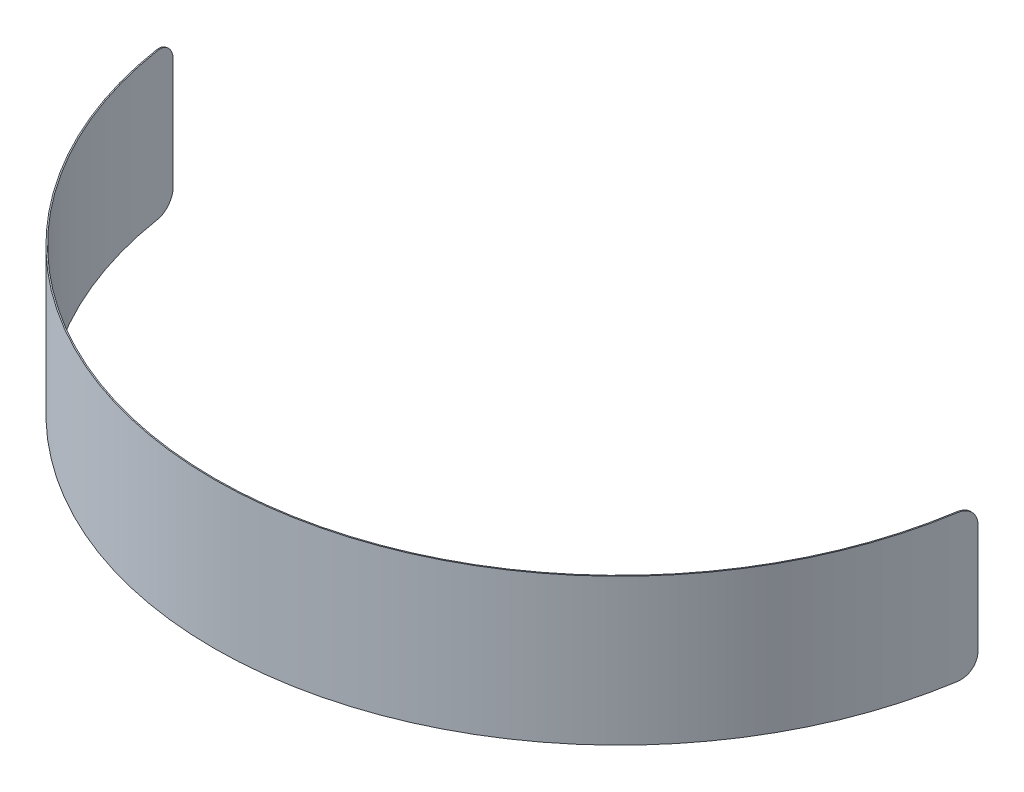
ISO-10303-21;
HEADER;
FILE_DESCRIPTION(('STEP AP214'),'2;1');
FILE_NAME('part.step','',(''),(''),'','','');
FILE_SCHEMA(('AUTOMOTIVE_DESIGN { 1 0 10303 214 1 1 1 1 }'));
ENDSEC;
DATA;
#1=APPLICATION_CONTEXT('core data for automotive mechanical design processes');
#2=APPLICATION_PROTOCOL_DEFINITION('international standard','automotive_design',2000,#1);
#3=PRODUCT_CONTEXT('',#1,'mechanical');
#4=PRODUCT('Part','Part','',(#3));
#5=PRODUCT_RELATED_PRODUCT_CATEGORY('part','',(#4));
#6=PRODUCT_DEFINITION_FORMATION('','',#4);
#7=PRODUCT_DEFINITION_CONTEXT('part definition',#1,'design');
#8=PRODUCT_DEFINITION('design','',#6,#7);
#9=PRODUCT_DEFINITION_SHAPE('','',#8);
#10=(LENGTH_UNIT() NAMED_UNIT(*) SI_UNIT(.MILLI.,.METRE.));
#11=(NAMED_UNIT(*) PLANE_ANGLE_UNIT() SI_UNIT($,.RADIAN.));
#12=(NAMED_UNIT(*) SI_UNIT($,.STERADIAN.) SOLID_ANGLE_UNIT());
#13=UNCERTAINTY_MEASURE_WITH_UNIT(LENGTH_MEASURE(1.E-05),#10,'distance_accuracy_value','');
#14=(GEOMETRIC_REPRESENTATION_CONTEXT(3) GLOBAL_UNCERTAINTY_ASSIGNED_CONTEXT((#13)) GLOBAL_UNIT_ASSIGNED_CONTEXT((#10,
#11,#12)) REPRESENTATION_CONTEXT('',''));
#15=CARTESIAN_POINT('',(0.,0.,0.));
#16=DIRECTION('',(0.,0.,1.));
#17=DIRECTION('',(1.,0.,0.));
#18=AXIS2_PLACEMENT_3D('',#15,#16,#17);
#19=CARTESIAN_POINT('',(65.1385173741729,0.0359811975371022,63.151));
#20=DIRECTION('',(0.,1.,0.));
#21=DIRECTION('',(-1.,0.,0.));
#22=AXIS2_PLACEMENT_3D('',#19,#20,#21);
#23=PLANE('',#22);
#24=CARTESIAN_POINT('',(65.1385173741729,0.0359811975371022,-44.4365));
#25=DIRECTION('',(0.,1.,0.));
#26=DIRECTION('',(-1.,0.,0.));
#27=AXIS2_PLACEMENT_3D('',#24,#25,#26);
#28=CIRCLE('',#27,44.4365);
#29=CARTESIAN_POINT('',(21.2315002120432,0.0359876084643461,-37.5971742888313));
#30=VERTEX_POINT('',#29);
#31=CARTESIAN_POINT('',(109.04553398088,0.0359888595236136,-37.5971707231431));
#32=VERTEX_POINT('',#31);
#33=EDGE_CURVE('E279',#30,#32,#28,.T.);
#34=ORIENTED_EDGE('',*,*,#33,.T.);
#35=CARTESIAN_POINT('',(109.171020713555,0.0359965025437752,-37.5776238602951));
#36=CARTESIAN_POINT('',(109.165792099664,0.0359964346935741,-37.5784383126943));
#37=CARTESIAN_POINT('',(109.160563485774,0.0359963754234303,-37.5792527650989));
#38=CARTESIAN_POINT('',(109.150106257994,0.0359962740432584,-37.5808816699163));
#39=CARTESIAN_POINT('',(109.144877644105,0.0359962319332302,-37.581696122329));
#40=CARTESIAN_POINT('',(109.134420416327,0.0359961648732905,-37.5833250271597));
#41=CARTESIAN_POINT('',(109.129191802438,0.035996139923379,-37.5841394795777));
#42=CARTESIAN_POINT('',(109.118734574661,0.0359961071836736,-37.5857683844164));
#43=CARTESIAN_POINT('',(109.113505960773,0.0359960993938798,-37.586582836837));
#44=CARTESIAN_POINT('',(109.103048732997,0.0359961009744089,-37.5882117416781));
#45=CARTESIAN_POINT('',(109.097820119109,0.035996110344732,-37.5890261940986));
#46=CARTESIAN_POINT('',(109.087362891332,0.0359961462454961,-37.5906550989368));
#47=CARTESIAN_POINT('',(109.082134277443,0.0359961727759372,-37.5914695513544));
#48=CARTESIAN_POINT('',(109.071677049665,0.0359962429969354,-37.5930984561841));
#49=CARTESIAN_POINT('',(109.066448435776,0.0359962866874926,-37.5939129085962));
#50=CARTESIAN_POINT('',(109.055991207996,0.0359963912287226,-37.595541813412));
#51=CARTESIAN_POINT('',(109.050762594105,0.0359964520793954,-37.5963562658158));
#52=CARTESIAN_POINT('',(109.045533980214,0.0359965215101258,-37.597170718214));
#53=B_SPLINE_CURVE_WITH_KNOTS('',3,(#35,#36,#37,#38,#39,#40,#41,#42,#43,#44,#45,#46,#47,#48,#49,
#50,#51,#52),.UNSPECIFIED.,.F.,.F.,(4,2,2,2,2,2,2,2,4),(0.,0.0158749999507811,
0.0317499999015549,0.0476249998523387,0.0634999998031089,0.079374999753884,0.0952499997046676,
0.11112499965545,0.126999999606222),.UNSPECIFIED.);
#54=CARTESIAN_POINT('',(109.171020712905,0.035988850040438,-37.5776238554842));
#55=VERTEX_POINT('',#54);
#56=EDGE_CURVE('E217',#55,#32,#53,.T.);
#57=ORIENTED_EDGE('',*,*,#56,.F.);
#58=CARTESIAN_POINT('',(65.1385173741729,0.0359811975371022,-44.4365));
#59=DIRECTION('',(0.,1.,0.));
#60=DIRECTION('',(-1.,0.,0.));
#61=AXIS2_PLACEMENT_3D('',#58,#59,#60);
#62=CIRCLE('',#61,44.5635);
#63=CARTESIAN_POINT('',(21.1060134773372,0.0359875942748701,-37.577627438443));
#64=VERTEX_POINT('',#63);
#65=EDGE_CURVE('E238',#64,#55,#62,.T.);
#66=ORIENTED_EDGE('',*,*,#65,.F.);
#67=CARTESIAN_POINT('',(21.1060140347908,0.0359811975371021,-37.5776238602951));
#68=DIRECTION('',(0.988084517586735,0.,-0.153912267559769));
#69=VECTOR('',#68,1.);
#70=LINE('',#67,#69);
#71=EDGE_CURVE('E275',#64,#30,#70,.T.);
#72=ORIENTED_EDGE('',*,*,#71,.T.);
#73=EDGE_LOOP('',(#34,#57,#66,#72));
#74=FACE_BOUND('',#73,.T.);
#75=ADVANCED_FACE('F200',(#74),#23,.F.);
#76=CARTESIAN_POINT('',(109.434716864185,2.0359811975371,-39.5628727070037));
#77=DIRECTION('',(-0.109363656198375,0.,0.994001806186952));
#78=DIRECTION('',(0.994001806186952,0.,0.109363656198375));
#79=AXIS2_PLACEMENT_3D('',#76,#77,#78);
#80=PLANE('',#79);
#81=DIRECTION('',(0.,1.,0.));
#82=VECTOR('',#81,1.);
#83=CARTESIAN_POINT('',(109.308478634799,2.0359811975371,-39.5767618913409));
#84=LINE('',#83,#82);
#85=CARTESIAN_POINT('',(109.308584973295,2.03598116761721,-39.5775488442539));
#86=VERTEX_POINT('',#85);
#87=CARTESIAN_POINT('',(109.30858982714,14.1141810099264,-39.577548107055));
#88=VERTEX_POINT('',#87);
#89=EDGE_CURVE('E299',#86,#88,#84,.T.);
#90=ORIENTED_EDGE('',*,*,#89,.T.);
#91=CARTESIAN_POINT('',(109.434509005933,14.1141812950622,-39.5613344610118));
#92=CARTESIAN_POINT('',(109.429266602036,14.1141812868343,-39.5620428502527));
#93=CARTESIAN_POINT('',(109.424024198139,14.1141812786065,-39.5627512394937));
#94=CARTESIAN_POINT('',(109.413539390346,14.1141812621508,-39.5641680179757));
#95=CARTESIAN_POINT('',(109.408296986449,14.114181253923,-39.5648764072166));
#96=CARTESIAN_POINT('',(109.397812178656,14.1141812374673,-39.5662931856986));
#97=CARTESIAN_POINT('',(109.392569774759,14.1141812292395,-39.5670015749395));
#98=CARTESIAN_POINT('',(109.382084966966,14.1141812127838,-39.5684183534215));
#99=CARTESIAN_POINT('',(109.376842563069,14.1141812045559,-39.5691267426625));
#100=CARTESIAN_POINT('',(109.366357755275,14.1141811881003,-39.5705435211444));
#101=CARTESIAN_POINT('',(109.361115351379,14.1141811798724,-39.5712519103854));
#102=CARTESIAN_POINT('',(109.350630543585,14.1141811634167,-39.5726686888673));
#103=CARTESIAN_POINT('',(109.345388139688,14.1141811551889,-39.5733770781083));
#104=CARTESIAN_POINT('',(109.334903331895,14.1141811387332,-39.5747938565902));
#105=CARTESIAN_POINT('',(109.329660927998,14.1141811305054,-39.5755022458312));
#106=CARTESIAN_POINT('',(109.319176120205,14.1141811140497,-39.5769190243132));
#107=CARTESIAN_POINT('',(109.313933716308,14.1141811058219,-39.5776274135541));
#108=CARTESIAN_POINT('',(109.308691312411,14.114181097594,-39.5783358027951));
#109=B_SPLINE_CURVE_WITH_KNOTS('',3,(#91,#92,#93,#94,#95,#96,#97,#98,#99,#100,#101,#102,#103,
#104,#105,#106,#107,#108),.UNSPECIFIED.,.F.,.F.,(4,2,2,2,2,2,2,2,4),(0.,0.0158701457271038,
0.0317402914542212,0.047610437181325,0.0634805829084287,0.0793507286355462,0.09522087436265,
0.111091020089767,0.12696116581687),.UNSPECIFIED.);
#110=CARTESIAN_POINT('',(109.43460819151,14.1141811333248,-39.5621043072711));
#111=VERTEX_POINT('',#110);
#112=EDGE_CURVE('E272',#111,#88,#109,.T.);
#113=ORIENTED_EDGE('',*,*,#112,.F.);
#114=DIRECTION('',(0.,1.,0.));
#115=VECTOR('',#114,1.);
#116=CARTESIAN_POINT('',(109.434716864185,0.0359811983798863,-39.5628727070037));
#117=LINE('',#116,#115);
#118=CARTESIAN_POINT('',(109.434612934762,2.03598106889212,-39.562103581294));
#119=VERTEX_POINT('',#118);
#120=EDGE_CURVE('E345',#119,#111,#117,.T.);
#121=ORIENTED_EDGE('',*,*,#120,.F.);
#122=CARTESIAN_POINT('',(109.434716864185,2.0359811975371,-39.5628727070037));
#123=DIRECTION('',(-0.994001806186952,0.,-0.109363656198377));
#124=VECTOR('',#123,1.);
#125=LINE('',#122,#124);
#126=EDGE_CURVE('E227',#119,#86,#125,.T.);
#127=ORIENTED_EDGE('',*,*,#126,.T.);
#128=EDGE_LOOP('',(#90,#113,#121,#127));
#129=FACE_BOUND('',#128,.T.);
#130=ADVANCED_FACE('F321',(#129),#80,.F.);
#131=CARTESIAN_POINT('',(111.148961859375,14.1143069446102,-37.3116312187196));
#132=DIRECTION('',(-0.99099352712004,-3.42590801119901E-11,-0.133909780099074));
#133=DIRECTION('',(-0.133909780099074,0.,0.99099352712004));
#134=AXIS2_PLACEMENT_3D('',#131,#132,#133);
#135=CYLINDRICAL_SURFACE('',#134,1.99985935040507);
#136=ORIENTED_EDGE('',*,*,#112,.T.);
#137=CARTESIAN_POINT('',(109.308652352847,14.1141809598259,-39.5783410672674));
#138=CARTESIAN_POINT('',(109.308652090242,14.1704396045123,-39.5783443125391));
#139=CARTESIAN_POINT('',(109.308393415169,14.2266714352459,-39.5759861864606));
#140=CARTESIAN_POINT('',(109.307356717354,14.3387327905778,-39.5665722367497));
#141=CARTESIAN_POINT('',(109.306578720313,14.3945623349467,-39.5595166455889));
#142=CARTESIAN_POINT('',(109.303465380226,14.560748473377,-39.5313721280404));
#143=CARTESIAN_POINT('',(109.300350701324,14.6699920000323,-39.503305276705));
#144=CARTESIAN_POINT('',(109.292027075112,14.882184089647,-39.4293569616788));
#145=CARTESIAN_POINT('',(109.286817136414,14.985129646065,-39.3834670652155));
#146=CARTESIAN_POINT('',(109.274290697902,15.1818063149062,-39.2752014051662));
#147=CARTESIAN_POINT('',(109.266974555581,15.2755389874469,-39.2128284394588));
#148=CARTESIAN_POINT('',(109.250243324593,15.4511490626311,-39.0733774350298));
#149=CARTESIAN_POINT('',(109.240827842185,15.5330242365897,-38.9962966381802));
#150=CARTESIAN_POINT('',(109.219948886978,15.682595099496,-38.8296322904499));
#151=CARTESIAN_POINT('',(109.208485021021,15.7502880609413,-38.7400463401062));
#152=CARTESIAN_POINT('',(109.183631609699,15.8695497815523,-38.5509644584667));
#153=CARTESIAN_POINT('',(109.170241999092,15.9211179942346,-38.4514681914513));
#154=CARTESIAN_POINT('',(109.141744454671,16.0066421870854,-38.245431969337));
#155=CARTESIAN_POINT('',(109.12663754148,16.0406085623024,-38.1388962135362));
#156=CARTESIAN_POINT('',(109.10047060832,16.081493021573,-37.9592798097031));
#157=CARTESIAN_POINT('',(109.08980654224,16.0936965007615,-37.8873000899286));
#158=CARTESIAN_POINT('',(109.068003127719,16.1100079289808,-37.7426063123373));
#159=CARTESIAN_POINT('',(109.056864475431,16.1141273450535,-37.6698934419542));
#160=CARTESIAN_POINT('',(109.045534535446,16.1141658712165,-37.5971742839913));
#161=B_SPLINE_CURVE_WITH_KNOTS('',3,(#137,#138,#139,#140,#141,#142,#143,#144,#145,#146,#147,
#148,#149,#150,#151,#152,#153,#154,#155,#156,#157,#158,#159,#160),.UNSPECIFIED.,.F.,.F.,(4,2,2,
2,2,2,2,2,2,2,2,4),(0.,0.168672232306347,0.337336117854877,0.674102842414998,1.01102909883541,
1.34789820122372,1.68483053814934,2.02182761405053,2.35883610987439,2.69564535243775,
2.91657133719152,3.13718371678471),.UNSPECIFIED.);
#162=CARTESIAN_POINT('',(109.045534536417,16.114174786033,-37.5971742897123));
#163=VERTEX_POINT('',#162);
#164=EDGE_CURVE('E300',#88,#163,#161,.T.);
#165=ORIENTED_EDGE('',*,*,#164,.T.);
#166=CARTESIAN_POINT('',(109.171020712255,16.1141811975371,-37.5776238506733));
#167=DIRECTION('',(-0.988084493769176,0.,-0.153912420463429));
#168=VECTOR('',#167,1.);
#169=LINE('',#166,#168);
#170=CARTESIAN_POINT('',(109.171021270897,16.1141748013611,-37.5776274375838));
#171=VERTEX_POINT('',#170);
#172=EDGE_CURVE('E458',#171,#163,#169,.T.);
#173=ORIENTED_EDGE('',*,*,#172,.F.);
#174=CARTESIAN_POINT('',(109.434547028327,14.1141811822034,-39.5613293231603));
#175=CARTESIAN_POINT('',(109.434546766998,14.1704398832439,-39.5613325619134));
#176=CARTESIAN_POINT('',(109.434287922778,14.2266717701187,-39.55897444763));
#177=CARTESIAN_POINT('',(109.433250562323,14.3387332377384,-39.5495605555614));
#178=CARTESIAN_POINT('',(109.432472071801,14.3945628382507,-39.5425050102112));
#179=CARTESIAN_POINT('',(109.429356792738,14.560749086249,-39.5143606869409));
#180=CARTESIAN_POINT('',(109.426240209701,14.6699926672824,-39.4862940408499));
#181=CARTESIAN_POINT('',(109.417911895998,14.8821848592817,-39.4123462306755));
#182=CARTESIAN_POINT('',(109.412699173621,14.985130463995,-39.3664566346759));
#183=CARTESIAN_POINT('',(109.400166821468,15.1818072866878,-39.2581915615523));
#184=CARTESIAN_POINT('',(109.392847547694,15.2755400580243,-39.1958188701737));
#185=CARTESIAN_POINT('',(109.376110362522,15.4511502607878,-39.0563683498096));
#186=CARTESIAN_POINT('',(109.366692057927,15.533025466269,-38.9792877660822));
#187=CARTESIAN_POINT('',(109.345808491457,15.6825961457432,-38.8126239503213));
#188=CARTESIAN_POINT('',(109.334342841808,15.7502889282511,-38.7230383504996));
#189=CARTESIAN_POINT('',(109.309487523288,15.8695501946775,-38.5339571114984));
#190=CARTESIAN_POINT('',(109.296097793844,15.9211181708046,-38.4344611603589));
#191=CARTESIAN_POINT('',(109.267602111634,16.0066423990151,-38.2284248147398));
#192=CARTESIAN_POINT('',(109.252497162287,16.04060888408,-38.1218885540014));
#193=CARTESIAN_POINT('',(109.22627525621,16.0815872163066,-37.9418577404744));
#194=CARTESIAN_POINT('',(109.215550179139,16.0938381338124,-37.8694550407663));
#195=CARTESIAN_POINT('',(109.193620762993,16.1101500178586,-37.7239102211033));
#196=CARTESIAN_POINT('',(109.182417118906,16.114222474337,-37.6507692837958));
#197=CARTESIAN_POINT('',(109.171021271847,16.1141658948293,-37.5776274431367));
#198=B_SPLINE_CURVE_WITH_KNOTS('',3,(#174,#175,#176,#177,#178,#179,#180,#181,#182,#183,#184,
#185,#186,#187,#188,#189,#190,#191,#192,#193,#194,#195,#196,#197),.UNSPECIFIED.,.F.,.F.,(4,2,2,
2,2,2,2,2,2,2,2,4),(0.,0.168672401462005,0.337336457411722,0.674103345597585,1.01102975035816,
1.34789924884286,1.68483190396615,2.02182844305854,2.35883559354966,2.69564659771223,
2.91785266717893,3.13974633984323),.UNSPECIFIED.);
#199=EDGE_CURVE('E343',#111,#171,#198,.T.);
#200=ORIENTED_EDGE('',*,*,#199,.F.);
#201=EDGE_LOOP('',(#136,#165,#173,#200));
#202=FACE_BOUND('',#201,.T.);
#203=ADVANCED_FACE('F316',(#202),#135,.T.);
#204=CARTESIAN_POINT('',(65.1385173741729,16.1141811975371,63.151));
#205=DIRECTION('',(0.,1.,0.));
#206=DIRECTION('',(-1.,0.,0.));
#207=AXIS2_PLACEMENT_3D('',#204,#205,#206);
#208=PLANE('',#207);
#209=ORIENTED_EDGE('',*,*,#172,.T.);
#210=CARTESIAN_POINT('',(65.1385173741729,16.1141811975371,-44.4365));
#211=DIRECTION('',(0.,1.,0.));
#212=DIRECTION('',(-1.,0.,0.));
#213=AXIS2_PLACEMENT_3D('',#210,#211,#212);
#214=CIRCLE('',#213,44.4365);
#215=CARTESIAN_POINT('',(21.2315007868884,16.1141735400378,-37.5971705982909));
#216=VERTEX_POINT('',#215);
#217=EDGE_CURVE('E447',#163,#216,#214,.F.);
#218=ORIENTED_EDGE('',*,*,#217,.T.);
#219=CARTESIAN_POINT('',(21.1060140347908,16.1141658925311,-37.5776238602951));
#220=CARTESIAN_POINT('',(21.1112426486819,16.1141659603813,-37.5784383126943));
#221=CARTESIAN_POINT('',(21.1164712625723,16.1141660196514,-37.5792527650989));
#222=CARTESIAN_POINT('',(21.126928490352,16.1141661210315,-37.5808816699163));
#223=CARTESIAN_POINT('',(21.1321571042412,16.1141661631415,-37.581696122329));
#224=CARTESIAN_POINT('',(21.1426143320191,16.1141662302015,-37.5833250271597));
#225=CARTESIAN_POINT('',(21.1478429459077,16.1141662551514,-37.5841394795777));
#226=CARTESIAN_POINT('',(21.1583001736844,16.114166287891,-37.5857683844164));
#227=CARTESIAN_POINT('',(21.1635287875727,16.1141662956808,-37.586582836837));
#228=CARTESIAN_POINT('',(21.1739860153491,16.1141662941003,-37.5882117416781));
#229=CARTESIAN_POINT('',(21.1792146292373,16.1141662847299,-37.5890261940986));
#230=CARTESIAN_POINT('',(21.1896718570142,16.1141662488292,-37.5906550989368));
#231=CARTESIAN_POINT('',(21.1949004709028,16.1141662222987,-37.5914695513544));
#232=CARTESIAN_POINT('',(21.2053576986808,16.1141661520777,-37.5930984561841));
#233=CARTESIAN_POINT('',(21.2105863125702,16.1141661083871,-37.5939129085962));
#234=CARTESIAN_POINT('',(21.22104354035,16.1141660038459,-37.595541813412));
#235=CARTESIAN_POINT('',(21.2262721542405,16.1141659429952,-37.5963562658158));
#236=CARTESIAN_POINT('',(21.2315007681318,16.1141658735644,-37.597170718214));
#237=B_SPLINE_CURVE_WITH_KNOTS('',3,(#219,#220,#221,#222,#223,#224,#225,#226,#227,#228,#229,
#230,#231,#232,#233,#234,#235,#236),.UNSPECIFIED.,.F.,.F.,(4,2,2,2,2,2,2,2,4),(0.,
0.0158749999507753,0.0317499999015491,0.047624999852325,0.0634999998030997,0.0793749997538747,
0.0952499997046505,0.111124999655423,0.126999999606199),.UNSPECIFIED.);
#238=CARTESIAN_POINT('',(21.1060140545923,16.1141735497327,-37.5776237326952));
#239=VERTEX_POINT('',#238);
#240=EDGE_CURVE('E400',#239,#216,#237,.T.);
#241=ORIENTED_EDGE('',*,*,#240,.F.);
#242=CARTESIAN_POINT('',(65.1385173741729,16.1141811975371,-44.4365));
#243=DIRECTION('',(0.,1.,0.));
#244=DIRECTION('',(-1.,0.,0.));
#245=AXIS2_PLACEMENT_3D('',#242,#243,#244);
#246=CIRCLE('',#245,44.5635);
#247=EDGE_CURVE('E427',#171,#239,#246,.F.);
#248=ORIENTED_EDGE('',*,*,#247,.F.);
#249=EDGE_LOOP('',(#209,#218,#241,#248));
#250=FACE_BOUND('',#249,.T.);
#251=ADVANCED_FACE('F320',(#250),#208,.T.);
#252=CARTESIAN_POINT('',(19.1136010260649,14.1143069445452,-37.3096756818228));
#253=DIRECTION('',(0.99099352709237,-1.68506727547382E-12,-0.133909780303845));
#254=DIRECTION('',(-0.133909780303845,0.,-0.99099352709237));
#255=AXIS2_PLACEMENT_3D('',#252,#253,#254);
#256=CYLINDRICAL_SURFACE('',#255,1.9998593504034);
#257=ORIENTED_EDGE('',*,*,#240,.T.);
#258=CARTESIAN_POINT('',(21.2315007877783,16.1141658736464,-37.5971705933941));
#259=CARTESIAN_POINT('',(21.2228469137616,16.1141290407224,-37.6527227172123));
#260=CARTESIAN_POINT('',(21.214304155381,16.1117215293452,-37.708263393953));
#261=CARTESIAN_POINT('',(21.1974881959879,16.1021888799704,-37.8189766980751));
#262=CARTESIAN_POINT('',(21.189214982178,16.0950639662893,-37.8741493428307));
#263=CARTESIAN_POINT('',(21.1648965707602,16.0666800606874,-38.038422074088));
#264=CARTESIAN_POINT('',(21.149323337369,16.0384115966868,-38.1464651084131));
#265=CARTESIAN_POINT('',(21.1198109429769,15.9639632488466,-38.3564263936552));
#266=CARTESIAN_POINT('',(21.1058725744656,15.9177747247272,-38.4583416626086));
#267=CARTESIAN_POINT('',(21.0798651245495,15.80880150428,-38.6531315130088));
#268=CARTESIAN_POINT('',(21.0677957250465,15.7460196370714,-38.7460076319158));
#269=CARTESIAN_POINT('',(21.0456682781669,15.6056247652374,-38.9200783202323));
#270=CARTESIAN_POINT('',(21.0356106521364,15.5280086603692,-39.0012704415463));
#271=CARTESIAN_POINT('',(21.0175783501076,15.3601336277533,-39.1496415726215));
#272=CARTESIAN_POINT('',(21.0096040883961,15.2698721908953,-39.2168177947207));
#273=CARTESIAN_POINT('',(20.9957565312995,15.0792157036572,-39.3352483546643));
#274=CARTESIAN_POINT('',(20.9898848612352,14.978812890438,-39.3864903712266));
#275=CARTESIAN_POINT('',(20.9802452421608,14.7707929431513,-39.4714848545792));
#276=CARTESIAN_POINT('',(20.9764760577448,14.6631800873846,-39.505247591232));
#277=CARTESIAN_POINT('',(20.9719564600462,14.4814555877175,-39.5459282629599));
#278=CARTESIAN_POINT('',(20.9706143404013,14.4084866535189,-39.5580793340271));
#279=CARTESIAN_POINT('',(20.9688282460706,14.2617490041611,-39.5742871922925));
#280=CARTESIAN_POINT('',(20.9683830062256,14.1879815633854,-39.5783553812783));
#281=CARTESIAN_POINT('',(20.9683823954956,14.1141811774558,-39.5783410672944));
#282=B_SPLINE_CURVE_WITH_KNOTS('',3,(#258,#259,#260,#261,#262,#263,#264,#265,#266,#267,#268,
#269,#270,#271,#272,#273,#274,#275,#276,#277,#278,#279,#280,#281),.UNSPECIFIED.,.F.,.F.,(4,2,2,
2,2,2,2,2,2,2,2,4),(0.,0.168562926452081,0.337117838168744,0.673663693672621,1.01037201912771,
1.347022973734,1.68374436291887,2.02053265986841,2.35758073780059,2.69443055944962,
2.91596618420241,3.13718908627537),.UNSPECIFIED.);
#283=CARTESIAN_POINT('',(20.9684497750502,14.114181227457,-39.5775488442605));
#284=VERTEX_POINT('',#283);
#285=EDGE_CURVE('E444',#216,#284,#282,.T.);
#286=ORIENTED_EDGE('',*,*,#285,.T.);
#287=CARTESIAN_POINT('',(20.8423178841607,14.1141811975371,-39.5628727070037));
#288=DIRECTION('',(0.994001806186952,0.,-0.10936365619838));
#289=VECTOR('',#288,1.);
#290=LINE('',#287,#289);
#291=CARTESIAN_POINT('',(20.8424218135848,14.1141813261821,-39.5621035812876));
#292=VERTEX_POINT('',#291);
#293=EDGE_CURVE('E463',#292,#284,#290,.T.);
#294=ORIENTED_EDGE('',*,*,#293,.F.);
#295=CARTESIAN_POINT('',(21.1060140537236,16.1141658924522,-37.5776237374758));
#296=CARTESIAN_POINT('',(21.0973601434677,16.1142012082372,-37.6331761050401));
#297=CARTESIAN_POINT('',(21.0888165774676,16.1118657937047,-37.6887199843926));
#298=CARTESIAN_POINT('',(21.0719975496707,16.1024767886614,-37.7994455961822));
#299=CARTESIAN_POINT('',(21.0637220751515,16.0954234223883,-37.854627345705));
#300=CARTESIAN_POINT('',(21.0393948524734,16.067252445956,-38.0189361386438));
#301=CARTESIAN_POINT('',(21.0238130323934,16.0391238949871,-38.1270149185701));
#302=CARTESIAN_POINT('',(20.9942790419166,15.9649471778653,-38.3370702579157));
#303=CARTESIAN_POINT('',(20.9803276619097,15.9188903670818,-38.43904384613));
#304=CARTESIAN_POINT('',(20.9542909513864,15.8101685957312,-38.6339713871239));
#305=CARTESIAN_POINT('',(20.9422053045859,15.7475064550468,-38.7269268676819));
#306=CARTESIAN_POINT('',(20.9200433981407,15.6073358976218,-38.9011748439746));
#307=CARTESIAN_POINT('',(20.9099675539957,15.5298244174584,-38.9824649270717));
#308=CARTESIAN_POINT('',(20.891897989379,15.362140695057,-39.1310479494863));
#309=CARTESIAN_POINT('',(20.883904677751,15.2719659721049,-39.1983381398166));
#310=CARTESIAN_POINT('',(20.8700191593459,15.0814627777495,-39.3170094418969));
#311=CARTESIAN_POINT('',(20.8641285666365,14.9811265818114,-39.3683783283309));
#312=CARTESIAN_POINT('',(20.8544518841747,14.773216899592,-39.4536365641188));
#313=CARTESIAN_POINT('',(20.8506645777831,14.6656476377128,-39.4875360177903));
#314=CARTESIAN_POINT('',(20.8461055687099,14.4835587528971,-39.5285413712454));
#315=CARTESIAN_POINT('',(20.8447470244476,14.4101789247804,-39.5408327649483));
#316=CARTESIAN_POINT('',(20.8429390406964,14.2626033446498,-39.5572283952551));
#317=CARTESIAN_POINT('',(20.8424883330181,14.1884088766167,-39.5613440527264));
#318=CARTESIAN_POINT('',(20.8424877200191,14.114181374973,-39.5613293231597));
#319=B_SPLINE_CURVE_WITH_KNOTS('',3,(#295,#296,#297,#298,#299,#300,#301,#302,#303,#304,#305,
#306,#307,#308,#309,#310,#311,#312,#313,#314,#315,#316,#317,#318),.UNSPECIFIED.,.F.,.F.,(4,2,2,
2,2,2,2,2,2,2,2,4),(0.,0.168563662861303,0.337119314696304,0.673666527028567,1.01037621677423,
1.34702876378186,1.68375083723829,2.02053896640851,2.35758506432969,2.69443599541072,
2.91724959531959,3.13975172247435),.UNSPECIFIED.);
#320=EDGE_CURVE('E426',#239,#292,#319,.T.);
#321=ORIENTED_EDGE('',*,*,#320,.F.);
#322=EDGE_LOOP('',(#257,#286,#294,#321));
#323=FACE_BOUND('',#322,.T.);
#324=ADVANCED_FACE('F406',(#323),#256,.T.);
#325=CARTESIAN_POINT('',(20.8423178841607,2.0359811975371,-39.5628727070037));
#326=DIRECTION('',(0.109363656198375,0.,0.994001806186952));
#327=DIRECTION('',(0.994001806186952,0.,-0.109363656198375));
#328=AXIS2_PLACEMENT_3D('',#325,#326,#327);
#329=PLANE('',#328);
#330=DIRECTION('',(0.,1.,0.));
#331=VECTOR('',#330,1.);
#332=CARTESIAN_POINT('',(20.9685561135464,2.0359811975371,-39.5767618913409));
#333=LINE('',#332,#331);
#334=CARTESIAN_POINT('',(20.9684449212043,2.03598138514784,-39.5775481070616));
#335=VERTEX_POINT('',#334);
#336=EDGE_CURVE('E295',#284,#335,#333,.F.);
#337=ORIENTED_EDGE('',*,*,#336,.T.);
#338=CARTESIAN_POINT('',(20.8425257424149,2.03598110001204,-39.5613344609991));
#339=CARTESIAN_POINT('',(20.8477681463115,2.03598110823988,-39.5620428502412));
#340=CARTESIAN_POINT('',(20.8530105502081,2.03598111646772,-39.5627512394833));
#341=CARTESIAN_POINT('',(20.8634953580012,2.0359811329234,-39.5641680179674));
#342=CARTESIAN_POINT('',(20.8687377618977,2.03598114115124,-39.5648764072094));
#343=CARTESIAN_POINT('',(20.8792225696909,2.03598115760692,-39.5662931856935));
#344=CARTESIAN_POINT('',(20.8844649735874,2.03598116583475,-39.5670015749356));
#345=CARTESIAN_POINT('',(20.8949497813805,2.03598118229043,-39.5684183534197));
#346=CARTESIAN_POINT('',(20.9001921852771,2.03598119051827,-39.5691267426617));
#347=CARTESIAN_POINT('',(20.9106769930702,2.03598120697395,-39.5705435211458));
#348=CARTESIAN_POINT('',(20.9159193969668,2.03598121520179,-39.5712519103879));
#349=CARTESIAN_POINT('',(20.9264042047599,2.03598123165747,-39.572668688872));
#350=CARTESIAN_POINT('',(20.9316466086565,2.03598123988531,-39.573377078114));
#351=CARTESIAN_POINT('',(20.9421314164496,2.03598125634098,-39.5747938565981));
#352=CARTESIAN_POINT('',(20.9473738203462,2.03598126456882,-39.5755022458402));
#353=CARTESIAN_POINT('',(20.9578586281393,2.0359812810245,-39.5769190243243));
#354=CARTESIAN_POINT('',(20.9631010320359,2.03598128925234,-39.5776274135663));
#355=CARTESIAN_POINT('',(20.9683434359324,2.03598129748018,-39.5783358028084));
#356=B_SPLINE_CURVE_WITH_KNOTS('',3,(#338,#339,#340,#341,#342,#343,#344,#345,#346,#347,#348,
#349,#350,#351,#352,#353,#354,#355),.UNSPECIFIED.,.F.,.F.,(4,2,2,2,2,2,2,2,4),(0.,
0.0158701457270288,0.0317402914540542,0.0476104371810821,0.0634805829081109,0.0793507286351363,
0.0952208743621642,0.111091020089192,0.126961165816221),.UNSPECIFIED.);
#357=CARTESIAN_POINT('',(20.8424265568374,2.03598126174937,-39.5621043072648));
#358=VERTEX_POINT('',#357);
#359=EDGE_CURVE('E285',#358,#335,#356,.T.);
#360=ORIENTED_EDGE('',*,*,#359,.F.);
#361=DIRECTION('',(0.,1.,0.));
#362=VECTOR('',#361,1.);
#363=CARTESIAN_POINT('',(20.8423178841607,0.0359811983798863,-39.5628727070037));
#364=LINE('',#363,#362);
#365=EDGE_CURVE('E373',#292,#358,#364,.F.);
#366=ORIENTED_EDGE('',*,*,#365,.F.);
#367=ORIENTED_EDGE('',*,*,#293,.T.);
#368=EDGE_LOOP('',(#337,#360,#366,#367));
#369=FACE_BOUND('',#368,.T.);
#370=ADVANCED_FACE('F378',(#369),#329,.F.);
#371=CARTESIAN_POINT('',(19.1280728889671,2.03585545053283,-37.3116312182909));
#372=DIRECTION('',(0.990993527092373,-1.87923810453408E-13,-0.133909780303821));
#373=DIRECTION('',(-0.133909780303821,0.,-0.990993527092373));
#374=AXIS2_PLACEMENT_3D('',#371,#372,#373);
#375=CYLINDRICAL_SURFACE('',#374,1.99985935040337);
#376=ORIENTED_EDGE('',*,*,#359,.T.);
#377=CARTESIAN_POINT('',(20.9683823954971,2.03598143524827,-39.5783410672808));
#378=CARTESIAN_POINT('',(20.9683826581023,1.9797227905621,-39.5783443125526));
#379=CARTESIAN_POINT('',(20.9686413331756,1.92349095982875,-39.5759861864743));
#380=CARTESIAN_POINT('',(20.9696780309905,1.81142960449723,-39.5665722367636));
#381=CARTESIAN_POINT('',(20.9704560280315,1.75560006012862,-39.559516645603));
#382=CARTESIAN_POINT('',(20.9735693681178,1.58941392169893,-39.5313721280549));
#383=CARTESIAN_POINT('',(20.9766840470207,1.48017039504407,-39.5033052767198));
#384=CARTESIAN_POINT('',(20.9850076732318,1.26797830543016,-39.4293569616943));
#385=CARTESIAN_POINT('',(20.99021761193,1.16503274901255,-39.3834670652314));
#386=CARTESIAN_POINT('',(21.0027440504422,0.968356080171973,-39.2752014051831));
#387=CARTESIAN_POINT('',(21.0100601927626,0.874623407631534,-39.2128284394761));
#388=CARTESIAN_POINT('',(21.0267914237504,0.699013332447286,-39.0733774350479));
#389=CARTESIAN_POINT('',(21.0362069061585,0.61713815848849,-38.9962966381987));
#390=CARTESIAN_POINT('',(21.0570858613656,0.467567295581667,-38.8296322904691));
#391=CARTESIAN_POINT('',(21.0685497273227,0.399874334136116,-38.7400463401258));
#392=CARTESIAN_POINT('',(21.0934031386439,0.280612613524126,-38.5509644584867));
#393=CARTESIAN_POINT('',(21.106792749251,0.22904440084124,-38.4514681914713));
#394=CARTESIAN_POINT('',(21.1352902936723,0.143520207989153,-38.2454319693567));
#395=CARTESIAN_POINT('',(21.1503972068628,0.109553832771471,-38.1388962135557));
#396=CARTESIAN_POINT('',(21.1765641400448,0.0686693734667087,-37.9592798095759));
#397=CARTESIAN_POINT('',(21.1872282061464,0.0564658942611297,-37.887300089652));
#398=CARTESIAN_POINT('',(21.2090316207141,0.0401544660407998,-37.74260631176));
#399=CARTESIAN_POINT('',(21.2201702730272,0.0360350499842914,-37.6698934412257));
#400=CARTESIAN_POINT('',(21.2315002130364,0.0359965238545066,-37.5971742831135));
#401=B_SPLINE_CURVE_WITH_KNOTS('',3,(#377,#378,#379,#380,#381,#382,#383,#384,#385,#386,#387,
#388,#389,#390,#391,#392,#393,#394,#395,#396,#397,#398,#399,#400),.UNSPECIFIED.,.F.,.F.,(4,2,2,
2,2,2,2,2,2,2,2,4),(0.,0.168672232305678,0.337336117853543,0.674102842412182,1.01102909883108,
1.34789820121798,1.68483053814343,2.02182761404415,2.35883610986876,2.69564535243395,
2.91657133764059,3.13718371768711),.UNSPECIFIED.);
#402=EDGE_CURVE('E290',#335,#30,#401,.T.);
#403=ORIENTED_EDGE('',*,*,#402,.T.);
#404=ORIENTED_EDGE('',*,*,#71,.F.);
#405=CARTESIAN_POINT('',(20.8424877200204,2.03598121287079,-39.5613293231477));
#406=CARTESIAN_POINT('',(20.8424879813497,1.97972251183054,-39.5613325619007));
#407=CARTESIAN_POINT('',(20.8427468255696,1.92349062495598,-39.5589744476173));
#408=CARTESIAN_POINT('',(20.8437841860241,1.81142915733678,-39.5495605555487));
#409=CARTESIAN_POINT('',(20.8445626765459,1.75559955682463,-39.5425050101986));
#410=CARTESIAN_POINT('',(20.8476779556089,1.58941330882709,-39.5143606869283));
#411=CARTESIAN_POINT('',(20.8507945386459,1.48016972779411,-39.4862940408374));
#412=CARTESIAN_POINT('',(20.8591228523494,1.26797753579573,-39.4123462306632));
#413=CARTESIAN_POINT('',(20.8643355747263,1.16503193108288,-39.3664566346638));
#414=CARTESIAN_POINT('',(20.8768679268788,0.968355108390953,-39.2581915615407));
#415=CARTESIAN_POINT('',(20.8841872006528,0.87462233705488,-39.1958188701624));
#416=CARTESIAN_POINT('',(20.9009243858249,0.699012134291727,-39.0563683497989));
#417=CARTESIAN_POINT('',(20.9103426904205,0.617136928810575,-38.9792877660717));
#418=CARTESIAN_POINT('',(20.9312262568906,0.467566249336213,-38.8126239503111));
#419=CARTESIAN_POINT('',(20.9426919065389,0.399873466828225,-38.7230383504896));
#420=CARTESIAN_POINT('',(20.9675472250588,0.280612200401038,-38.5339571114883));
#421=CARTESIAN_POINT('',(20.9809369545029,0.229044224273442,-38.4344611603484));
#422=CARTESIAN_POINT('',(21.0094326367135,0.143519996062105,-38.2284248147286));
#423=CARTESIAN_POINT('',(21.0245375860608,0.109553510996881,-38.12188855399));
#424=CARTESIAN_POINT('',(21.0507594921166,0.068575178802033,-37.941857740604));
#425=CARTESIAN_POINT('',(21.0614845691663,0.0563242613123064,-37.8694550410405));
#426=CARTESIAN_POINT('',(21.083413985267,0.0400123772658791,-37.7239102216683));
#427=CARTESIAN_POINT('',(21.094617629331,0.035939920771222,-37.650769284507));
#428=CARTESIAN_POINT('',(21.1060134763653,0.0359965002461543,-37.5776274439923));
#429=B_SPLINE_CURVE_WITH_KNOTS('',3,(#405,#406,#407,#408,#409,#410,#411,#412,#413,#414,#415,
#416,#417,#418,#419,#420,#421,#422,#423,#424,#425,#426,#427,#428),.UNSPECIFIED.,.F.,.F.,(4,2,2,
2,2,2,2,2,2,2,2,4),(0.,0.168672401461308,0.337336457410321,0.674103345594781,1.01102975035394,
1.34789924883716,1.68483190395996,2.02182844305218,2.35883559354513,2.69564659770844,
2.91785266673736,3.13974633896347),.UNSPECIFIED.);
#430=EDGE_CURVE('E371',#358,#64,#429,.T.);
#431=ORIENTED_EDGE('',*,*,#430,.F.);
#432=EDGE_LOOP('',(#376,#403,#404,#431));
#433=FACE_BOUND('',#432,.T.);
#434=ADVANCED_FACE('F291',(#433),#375,.T.);
#435=CARTESIAN_POINT('',(65.1385173741729,0.0359811983798863,-44.4365));
#436=DIRECTION('',(0.,1.,0.));
#437=DIRECTION('',(1.,0.,0.));
#438=AXIS2_PLACEMENT_3D('',#435,#436,#437);
#439=CYLINDRICAL_SURFACE('',#438,44.4365);
#440=ORIENTED_EDGE('',*,*,#33,.F.);
#441=ORIENTED_EDGE('',*,*,#402,.F.);
#442=ORIENTED_EDGE('',*,*,#336,.F.);
#443=ORIENTED_EDGE('',*,*,#285,.F.);
#444=ORIENTED_EDGE('',*,*,#217,.F.);
#445=ORIENTED_EDGE('',*,*,#164,.F.);
#446=ORIENTED_EDGE('',*,*,#89,.F.);
#447=CARTESIAN_POINT('',(109.045533980015,0.0359965215101276,-37.5971707182448));
#448=CARTESIAN_POINT('',(109.054187853874,0.0360333579854146,-37.6527228420854));
#449=CARTESIAN_POINT('',(109.062730612073,0.0384408729123715,-37.7082635187003));
#450=CARTESIAN_POINT('',(109.079546571062,0.0479735293618426,-37.8189768222749));
#451=CARTESIAN_POINT('',(109.087819784649,0.055098446567847,-37.8741494666089));
#452=CARTESIAN_POINT('',(109.112138195344,0.0834823626629695,-38.0384221961632));
#453=CARTESIAN_POINT('',(109.127711428181,0.111750833562488,-38.1464652287665));
#454=CARTESIAN_POINT('',(109.157223821355,0.18619919480377,-38.3564265094342));
#455=CARTESIAN_POINT('',(109.171162189204,0.232387725424981,-38.4583417755345));
#456=CARTESIAN_POINT('',(109.197169637725,0.341360958292154,-38.6531316191747));
#457=CARTESIAN_POINT('',(109.209239036494,0.404142831418419,-38.7460077341753));
#458=CARTESIAN_POINT('',(109.231366481869,0.544537714342763,-38.9200784137448));
#459=CARTESIAN_POINT('',(109.241424107128,0.622153824384579,-39.0012705302172));
#460=CARTESIAN_POINT('',(109.259456407599,0.790028866466228,-39.1496416508133));
#461=CARTESIAN_POINT('',(109.267430668523,0.880290307617814,-39.2168178672731));
#462=CARTESIAN_POINT('',(109.281278224044,1.07094680243602,-39.3352484152919));
#463=CARTESIAN_POINT('',(109.28714989332,1.17134961894197,-39.3864904255665));
#464=CARTESIAN_POINT('',(109.29678951082,1.37936957166694,-39.4714848958546));
#465=CARTESIAN_POINT('',(109.300558694451,1.48698242958234,-39.5052476257387));
#466=CARTESIAN_POINT('',(109.305078290342,1.66870691123743,-39.5459282814364));
#467=CARTESIAN_POINT('',(109.30642040922,1.74167582513608,-39.558079345587));
#468=CARTESIAN_POINT('',(109.308206502529,1.8884134331014,-39.5742871945976));
#469=CARTESIAN_POINT('',(109.308651742119,1.9621808527852,-39.5783553812441));
#470=CARTESIAN_POINT('',(109.308652352849,2.03598121761839,-39.578341067281));
#471=B_SPLINE_CURVE_WITH_KNOTS('',3,(#447,#448,#449,#450,#451,#452,#453,#454,#455,#456,#457,
#458,#459,#460,#461,#462,#463,#464,#465,#466,#467,#468,#469,#470),.UNSPECIFIED.,.F.,.F.,(4,2,2,
2,2,2,2,2,2,2,2,4),(0.,0.168562926452591,0.33711783816957,0.673663693682401,1.01037201914598,
1.34702297374889,1.68374436295285,2.02053265996334,2.35758073799125,2.69443055958339,
2.91596612121148,3.13718896009977),.UNSPECIFIED.);
#472=EDGE_CURVE('E209',#32,#86,#471,.T.);
#473=ORIENTED_EDGE('',*,*,#472,.F.);
#474=EDGE_LOOP('',(#440,#441,#442,#443,#444,#445,#446,#473));
#475=FACE_BOUND('',#474,.T.);
#476=ADVANCED_FACE('F297',(#475),#439,.F.);
#477=CARTESIAN_POINT('',(65.1385173741729,0.0359811983798863,-44.4365));
#478=DIRECTION('',(0.,1.,0.));
#479=DIRECTION('',(1.,0.,0.));
#480=AXIS2_PLACEMENT_3D('',#477,#478,#479);
#481=CYLINDRICAL_SURFACE('',#480,44.5635);
#482=ORIENTED_EDGE('',*,*,#65,.T.);
#483=CARTESIAN_POINT('',(109.171020713749,0.0359965025437774,-37.577623860265));
#484=CARTESIAN_POINT('',(109.17967462385,0.0359611902506696,-37.6331762278558));
#485=CARTESIAN_POINT('',(109.188218189673,0.038296608273861,-37.6887201070889));
#486=CARTESIAN_POINT('',(109.205037217075,0.0476856202743273,-37.7994457183488));
#487=CARTESIAN_POINT('',(109.213312691376,0.0547389900139397,-37.8546274674613));
#488=CARTESIAN_POINT('',(109.237639913346,0.0829099767662742,-38.0189362587385));
#489=CARTESIAN_POINT('',(109.253221732882,0.111038534520979,-38.1270150369802));
#490=CARTESIAN_POINT('',(109.282755722165,0.185215264825665,-38.3370703718443));
#491=CARTESIAN_POINT('',(109.296707101522,0.231272082005968,-38.4390439572612));
#492=CARTESIAN_POINT('',(109.322743810675,0.339993865577428,-38.6339714916235));
#493=CARTESIAN_POINT('',(109.334829456756,0.402656012085508,-38.7269269683477));
#494=CARTESIAN_POINT('',(109.356991361723,0.542826580426536,-38.9011749360535));
#495=CARTESIAN_POINT('',(109.36706720511,0.620338065683138,-38.9824650143964));
#496=CARTESIAN_POINT('',(109.385136768195,0.788021797405089,-39.131048026519));
#497=CARTESIAN_POINT('',(109.393130079049,0.878196524586087,-39.1983382113096));
#498=CARTESIAN_POINT('',(109.407015595905,1.06869972640966,-39.3170095016742));
#499=CARTESIAN_POINT('',(109.412906187839,1.16903592558742,-39.3683783819299));
#500=CARTESIAN_POINT('',(109.422582868751,1.37694561317056,-39.453636604879));
#501=CARTESIAN_POINT('',(109.426370174371,1.48451487717125,-39.4875360518977));
#502=CARTESIAN_POINT('',(109.43092918166,1.66660374430343,-39.5285413895431));
#503=CARTESIAN_POINT('',(109.432287725163,1.73998355246915,-39.5408327764065));
#504=CARTESIAN_POINT('',(109.434095707903,1.88755909190842,-39.5572283975607));
#505=CARTESIAN_POINT('',(109.43454641533,1.96175353920165,-39.5613440527182));
#506=CARTESIAN_POINT('',(109.434547028328,2.0359810201012,-39.5613293231724));
#507=B_SPLINE_CURVE_WITH_KNOTS('',3,(#483,#484,#485,#486,#487,#488,#489,#490,#491,#492,#493,
#494,#495,#496,#497,#498,#499,#500,#501,#502,#503,#504,#505,#506),.UNSPECIFIED.,.F.,.F.,(4,2,2,
2,2,2,2,2,2,2,2,4),(0.,0.168563662861695,0.337119314696896,0.673666527037702,1.01037621679144,
1.34702876379549,1.68375083727048,2.02053896650028,2.35758506451532,2.69443599554074,
2.91724953338412,3.13975159841003),.UNSPECIFIED.);
#508=EDGE_CURVE('E13',#55,#119,#507,.T.);
#509=ORIENTED_EDGE('',*,*,#508,.T.);
#510=ORIENTED_EDGE('',*,*,#120,.T.);
#511=ORIENTED_EDGE('',*,*,#199,.T.);
#512=ORIENTED_EDGE('',*,*,#247,.T.);
#513=ORIENTED_EDGE('',*,*,#320,.T.);
#514=ORIENTED_EDGE('',*,*,#365,.T.);
#515=ORIENTED_EDGE('',*,*,#430,.T.);
#516=EDGE_LOOP('',(#482,#509,#510,#511,#512,#513,#514,#515));
#517=FACE_BOUND('',#516,.T.);
#518=ADVANCED_FACE('F347',(#517),#481,.T.);
#519=CARTESIAN_POINT('',(111.16343372273,2.03585545053496,-37.3096756821939));
#520=DIRECTION('',(-0.990993527120039,-4.24113216291205E-13,-0.133909780099082));
#521=DIRECTION('',(-0.133909780099082,0.,0.990993527120039));
#522=AXIS2_PLACEMENT_3D('',#519,#520,#521);
#523=CYLINDRICAL_SURFACE('',#522,1.99985935040452);
#524=ORIENTED_EDGE('',*,*,#56,.T.);
#525=ORIENTED_EDGE('',*,*,#472,.T.);
#526=ORIENTED_EDGE('',*,*,#126,.F.);
#527=ORIENTED_EDGE('',*,*,#508,.F.);
#528=EDGE_LOOP('',(#524,#525,#526,#527));
#529=FACE_BOUND('',#528,.T.);
#530=ADVANCED_FACE('F351',(#529),#523,.T.);
#531=CLOSED_SHELL('',(#75,#130,#203,#251,#324,#370,#434,#476,#518,#530));
#532=MANIFOLD_SOLID_BREP('B2',#531);
#533=ADVANCED_BREP_SHAPE_REPRESENTATION('',(#18,#532),#14);
#534=SHAPE_DEFINITION_REPRESENTATION(#9,#533);
ENDSEC;
END-ISO-10303-21;
